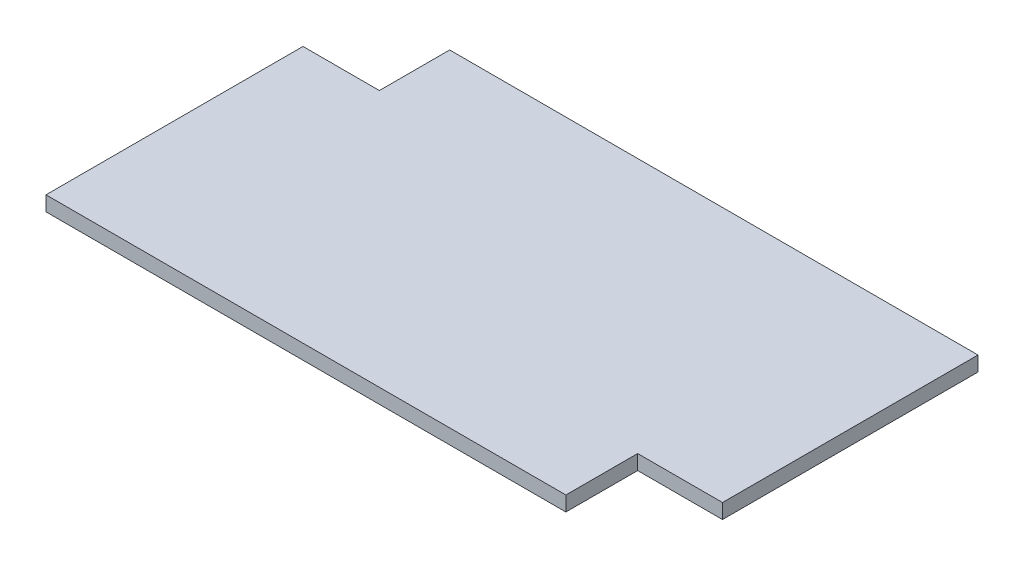
ISO-10303-21;
HEADER;
FILE_DESCRIPTION(('STEP AP214'),'2;1');
FILE_NAME('part.step','',(''),(''),'','','');
FILE_SCHEMA(('AUTOMOTIVE_DESIGN { 1 0 10303 214 1 1 1 1 }'));
ENDSEC;
DATA;
#1=APPLICATION_CONTEXT('core data for automotive mechanical design processes');
#2=APPLICATION_PROTOCOL_DEFINITION('international standard','automotive_design',2000,#1);
#3=PRODUCT_CONTEXT('',#1,'mechanical');
#4=PRODUCT('Part','Part','',(#3));
#5=PRODUCT_RELATED_PRODUCT_CATEGORY('part','',(#4));
#6=PRODUCT_DEFINITION_FORMATION('','',#4);
#7=PRODUCT_DEFINITION_CONTEXT('part definition',#1,'design');
#8=PRODUCT_DEFINITION('design','',#6,#7);
#9=PRODUCT_DEFINITION_SHAPE('','',#8);
#10=(LENGTH_UNIT() NAMED_UNIT(*) SI_UNIT(.MILLI.,.METRE.));
#11=(NAMED_UNIT(*) PLANE_ANGLE_UNIT() SI_UNIT($,.RADIAN.));
#12=(NAMED_UNIT(*) SI_UNIT($,.STERADIAN.) SOLID_ANGLE_UNIT());
#13=UNCERTAINTY_MEASURE_WITH_UNIT(LENGTH_MEASURE(1.E-05),#10,'distance_accuracy_value','');
#14=(GEOMETRIC_REPRESENTATION_CONTEXT(3) GLOBAL_UNCERTAINTY_ASSIGNED_CONTEXT((#13)) GLOBAL_UNIT_ASSIGNED_CONTEXT((#10,
#11,#12)) REPRESENTATION_CONTEXT('',''));
#15=CARTESIAN_POINT('',(0.,0.,0.));
#16=DIRECTION('',(0.,0.,1.));
#17=DIRECTION('',(1.,0.,0.));
#18=AXIS2_PLACEMENT_3D('',#15,#16,#17);
#19=CARTESIAN_POINT('',(62.5573089688317,3.,-17.5518394228049));
#20=DIRECTION('',(-1.,0.,0.));
#21=DIRECTION('',(0.,0.,1.));
#22=AXIS2_PLACEMENT_3D('',#19,#20,#21);
#23=PLANE('',#22);
#24=DIRECTION('',(0.,0.,-1.));
#25=VECTOR('',#24,1.);
#26=CARTESIAN_POINT('',(62.5573089688317,0.,-17.5518394228049));
#27=LINE('',#26,#25);
#28=CARTESIAN_POINT('',(62.5573089688317,0.,34.3263248161733));
#29=VERTEX_POINT('',#28);
#30=CARTESIAN_POINT('',(62.5573089688317,0.,-17.5518394228049));
#31=VERTEX_POINT('',#30);
#32=EDGE_CURVE('E133',#29,#31,#27,.T.);
#33=ORIENTED_EDGE('',*,*,#32,.T.);
#34=DIRECTION('',(0.,-1.,0.));
#35=VECTOR('',#34,1.);
#36=CARTESIAN_POINT('',(62.5573089688317,3.,-17.5518394228049));
#37=LINE('',#36,#35);
#38=CARTESIAN_POINT('',(62.5573089688317,3.,-17.5518394228049));
#39=VERTEX_POINT('',#38);
#40=EDGE_CURVE('E11',#39,#31,#37,.T.);
#41=ORIENTED_EDGE('',*,*,#40,.F.);
#42=DIRECTION('',(0.,0.,-1.));
#43=VECTOR('',#42,1.);
#44=CARTESIAN_POINT('',(62.5573089688317,3.,-17.5518394228049));
#45=LINE('',#44,#43);
#46=CARTESIAN_POINT('',(62.5573089688317,3.,34.3263248161733));
#47=VERTEX_POINT('',#46);
#48=EDGE_CURVE('E147',#47,#39,#45,.T.);
#49=ORIENTED_EDGE('',*,*,#48,.F.);
#50=DIRECTION('',(0.,-1.,0.));
#51=VECTOR('',#50,1.);
#52=CARTESIAN_POINT('',(62.5573089688317,3.,34.3263248161733));
#53=LINE('',#52,#51);
#54=EDGE_CURVE('E129',#47,#29,#53,.T.);
#55=ORIENTED_EDGE('',*,*,#54,.T.);
#56=EDGE_LOOP('',(#33,#41,#49,#55));
#57=FACE_BOUND('',#56,.T.);
#58=ADVANCED_FACE('F37',(#57),#23,.F.);
#59=CARTESIAN_POINT('',(62.5573089688317,3.,-17.5518394228049));
#60=DIRECTION('',(0.,0.,1.));
#61=DIRECTION('',(1.,0.,0.));
#62=AXIS2_PLACEMENT_3D('',#59,#60,#61);
#63=PLANE('',#62);
#64=DIRECTION('',(-1.,0.,0.));
#65=VECTOR('',#64,1.);
#66=CARTESIAN_POINT('',(62.5573089688317,0.,-17.5518394228049));
#67=LINE('',#66,#65);
#68=CARTESIAN_POINT('',(-44.7186115124712,0.,-17.5518394228049));
#69=VERTEX_POINT('',#68);
#70=EDGE_CURVE('E136',#31,#69,#67,.T.);
#71=ORIENTED_EDGE('',*,*,#70,.T.);
#72=DIRECTION('',(0.,-1.,0.));
#73=VECTOR('',#72,1.);
#74=CARTESIAN_POINT('',(-44.7186115124712,3.,-17.5518394228049));
#75=LINE('',#74,#73);
#76=CARTESIAN_POINT('',(-44.7186115124712,3.,-17.5518394228049));
#77=VERTEX_POINT('',#76);
#78=EDGE_CURVE('E45',#77,#69,#75,.T.);
#79=ORIENTED_EDGE('',*,*,#78,.F.);
#80=DIRECTION('',(-1.,0.,0.));
#81=VECTOR('',#80,1.);
#82=CARTESIAN_POINT('',(62.5573089688317,3.,-17.5518394228049));
#83=LINE('',#82,#81);
#84=EDGE_CURVE('E96',#39,#77,#83,.T.);
#85=ORIENTED_EDGE('',*,*,#84,.F.);
#86=ORIENTED_EDGE('',*,*,#40,.T.);
#87=EDGE_LOOP('',(#71,#79,#85,#86));
#88=FACE_BOUND('',#87,.T.);
#89=ADVANCED_FACE('F182',(#88),#63,.F.);
#90=CARTESIAN_POINT('',(-44.7186115124712,3.,-3.28093689020645));
#91=DIRECTION('',(1.,0.,0.));
#92=DIRECTION('',(0.,0.,-1.));
#93=AXIS2_PLACEMENT_3D('',#90,#91,#92);
#94=PLANE('',#93);
#95=DIRECTION('',(0.,0.,1.));
#96=VECTOR('',#95,1.);
#97=CARTESIAN_POINT('',(-44.7186115124712,0.,-3.28093689020645));
#98=LINE('',#97,#96);
#99=CARTESIAN_POINT('',(-44.7186115124712,0.,-3.28093689020645));
#100=VERTEX_POINT('',#99);
#101=EDGE_CURVE('E138',#69,#100,#98,.T.);
#102=ORIENTED_EDGE('',*,*,#101,.T.);
#103=DIRECTION('',(0.,-1.,0.));
#104=VECTOR('',#103,1.);
#105=CARTESIAN_POINT('',(-44.7186115124712,3.,-3.28093689020645));
#106=LINE('',#105,#104);
#107=CARTESIAN_POINT('',(-44.7186115124712,3.,-3.28093689020645));
#108=VERTEX_POINT('',#107);
#109=EDGE_CURVE('E154',#108,#100,#106,.T.);
#110=ORIENTED_EDGE('',*,*,#109,.F.);
#111=DIRECTION('',(0.,0.,1.));
#112=VECTOR('',#111,1.);
#113=CARTESIAN_POINT('',(-44.7186115124712,3.,-3.28093689020645));
#114=LINE('',#113,#112);
#115=EDGE_CURVE('E162',#77,#108,#114,.T.);
#116=ORIENTED_EDGE('',*,*,#115,.F.);
#117=ORIENTED_EDGE('',*,*,#78,.T.);
#118=EDGE_LOOP('',(#102,#110,#116,#117));
#119=FACE_BOUND('',#118,.T.);
#120=ADVANCED_FACE('F160',(#119),#94,.F.);
#121=CARTESIAN_POINT('',(-60.2273212246514,3.,-3.28093689020645));
#122=DIRECTION('',(0.,0.,1.));
#123=DIRECTION('',(1.,0.,0.));
#124=AXIS2_PLACEMENT_3D('',#121,#122,#123);
#125=PLANE('',#124);
#126=DIRECTION('',(-1.,0.,0.));
#127=VECTOR('',#126,1.);
#128=CARTESIAN_POINT('',(-60.2273212246514,0.,-3.28093689020645));
#129=LINE('',#128,#127);
#130=CARTESIAN_POINT('',(-60.2273212246514,0.,-3.28093689020645));
#131=VERTEX_POINT('',#130);
#132=EDGE_CURVE('E140',#100,#131,#129,.T.);
#133=ORIENTED_EDGE('',*,*,#132,.T.);
#134=DIRECTION('',(0.,-1.,0.));
#135=VECTOR('',#134,1.);
#136=CARTESIAN_POINT('',(-60.2273212246514,3.,-3.28093689020645));
#137=LINE('',#136,#135);
#138=CARTESIAN_POINT('',(-60.2273212246514,3.,-3.28093689020645));
#139=VERTEX_POINT('',#138);
#140=EDGE_CURVE('E151',#139,#131,#137,.T.);
#141=ORIENTED_EDGE('',*,*,#140,.F.);
#142=DIRECTION('',(-1.,0.,0.));
#143=VECTOR('',#142,1.);
#144=CARTESIAN_POINT('',(-60.2273212246514,3.,-3.28093689020645));
#145=LINE('',#144,#143);
#146=EDGE_CURVE('E174',#108,#139,#145,.T.);
#147=ORIENTED_EDGE('',*,*,#146,.F.);
#148=ORIENTED_EDGE('',*,*,#109,.T.);
#149=EDGE_LOOP('',(#133,#141,#147,#148));
#150=FACE_BOUND('',#149,.T.);
#151=ADVANCED_FACE('F170',(#150),#125,.F.);
#152=CARTESIAN_POINT('',(-60.2273212246514,3.,-3.28093689020645));
#153=DIRECTION('',(1.,0.,0.));
#154=DIRECTION('',(0.,0.,-1.));
#155=AXIS2_PLACEMENT_3D('',#152,#153,#154);
#156=PLANE('',#155);
#157=DIRECTION('',(0.,0.,1.));
#158=VECTOR('',#157,1.);
#159=CARTESIAN_POINT('',(-60.2273212246514,0.,-3.28093689020645));
#160=LINE('',#159,#158);
#161=CARTESIAN_POINT('',(-60.2273212246514,0.,48.9001947582394));
#162=VERTEX_POINT('',#161);
#163=EDGE_CURVE('E142',#131,#162,#160,.T.);
#164=ORIENTED_EDGE('',*,*,#163,.T.);
#165=DIRECTION('',(0.,-1.,0.));
#166=VECTOR('',#165,1.);
#167=CARTESIAN_POINT('',(-60.2273212246514,3.,48.9001947582394));
#168=LINE('',#167,#166);
#169=CARTESIAN_POINT('',(-60.2273212246514,3.,48.9001947582394));
#170=VERTEX_POINT('',#169);
#171=EDGE_CURVE('E124',#170,#162,#168,.T.);
#172=ORIENTED_EDGE('',*,*,#171,.F.);
#173=DIRECTION('',(0.,0.,1.));
#174=VECTOR('',#173,1.);
#175=CARTESIAN_POINT('',(-60.2273212246514,3.,-3.28093689020645));
#176=LINE('',#175,#174);
#177=EDGE_CURVE('E115',#139,#170,#176,.T.);
#178=ORIENTED_EDGE('',*,*,#177,.F.);
#179=ORIENTED_EDGE('',*,*,#140,.T.);
#180=EDGE_LOOP('',(#164,#172,#178,#179));
#181=FACE_BOUND('',#180,.T.);
#182=ADVANCED_FACE('F173',(#181),#156,.F.);
#183=CARTESIAN_POINT('',(45.3312162182008,3.,48.9001947582393));
#184=DIRECTION('',(0.,0.,-1.));
#185=DIRECTION('',(-1.,0.,0.));
#186=AXIS2_PLACEMENT_3D('',#183,#184,#185);
#187=PLANE('',#186);
#188=DIRECTION('',(1.,0.,0.));
#189=VECTOR('',#188,1.);
#190=CARTESIAN_POINT('',(45.3312162182008,0.,48.9001947582393));
#191=LINE('',#190,#189);
#192=CARTESIAN_POINT('',(45.3312162182008,0.,48.9001947582393));
#193=VERTEX_POINT('',#192);
#194=EDGE_CURVE('E123',#162,#193,#191,.T.);
#195=ORIENTED_EDGE('',*,*,#194,.T.);
#196=DIRECTION('',(0.,-1.,0.));
#197=VECTOR('',#196,1.);
#198=CARTESIAN_POINT('',(45.3312162182008,3.,48.9001947582393));
#199=LINE('',#198,#197);
#200=CARTESIAN_POINT('',(45.3312162182008,3.,48.9001947582393));
#201=VERTEX_POINT('',#200);
#202=EDGE_CURVE('E120',#201,#193,#199,.T.);
#203=ORIENTED_EDGE('',*,*,#202,.F.);
#204=DIRECTION('',(1.,0.,0.));
#205=VECTOR('',#204,1.);
#206=CARTESIAN_POINT('',(45.3312162182008,3.,48.9001947582393));
#207=LINE('',#206,#205);
#208=EDGE_CURVE('E109',#170,#201,#207,.T.);
#209=ORIENTED_EDGE('',*,*,#208,.F.);
#210=ORIENTED_EDGE('',*,*,#171,.T.);
#211=EDGE_LOOP('',(#195,#203,#209,#210));
#212=FACE_BOUND('',#211,.T.);
#213=ADVANCED_FACE('F121',(#212),#187,.F.);
#214=CARTESIAN_POINT('',(45.3312162182008,3.,48.9001947582393));
#215=DIRECTION('',(-1.,0.,0.));
#216=DIRECTION('',(0.,0.,1.));
#217=AXIS2_PLACEMENT_3D('',#214,#215,#216);
#218=PLANE('',#217);
#219=DIRECTION('',(0.,0.,-1.));
#220=VECTOR('',#219,1.);
#221=CARTESIAN_POINT('',(45.3312162182008,0.,48.9001947582393));
#222=LINE('',#221,#220);
#223=CARTESIAN_POINT('',(45.3312162182008,0.,34.3263248161733));
#224=VERTEX_POINT('',#223);
#225=EDGE_CURVE('E82',#193,#224,#222,.T.);
#226=ORIENTED_EDGE('',*,*,#225,.T.);
#227=DIRECTION('',(0.,-1.,0.));
#228=VECTOR('',#227,1.);
#229=CARTESIAN_POINT('',(45.3312162182008,3.,34.3263248161733));
#230=LINE('',#229,#228);
#231=CARTESIAN_POINT('',(45.3312162182008,3.,34.3263248161733));
#232=VERTEX_POINT('',#231);
#233=EDGE_CURVE('E125',#232,#224,#230,.T.);
#234=ORIENTED_EDGE('',*,*,#233,.F.);
#235=DIRECTION('',(0.,0.,-1.));
#236=VECTOR('',#235,1.);
#237=CARTESIAN_POINT('',(45.3312162182008,3.,48.9001947582393));
#238=LINE('',#237,#236);
#239=EDGE_CURVE('E113',#201,#232,#238,.T.);
#240=ORIENTED_EDGE('',*,*,#239,.F.);
#241=ORIENTED_EDGE('',*,*,#202,.T.);
#242=EDGE_LOOP('',(#226,#234,#240,#241));
#243=FACE_BOUND('',#242,.T.);
#244=ADVANCED_FACE('F127',(#243),#218,.F.);
#245=CARTESIAN_POINT('',(45.3312162182008,3.,34.3263248161733));
#246=DIRECTION('',(0.,0.,-1.));
#247=DIRECTION('',(-1.,0.,0.));
#248=AXIS2_PLACEMENT_3D('',#245,#246,#247);
#249=PLANE('',#248);
#250=DIRECTION('',(1.,0.,0.));
#251=VECTOR('',#250,1.);
#252=CARTESIAN_POINT('',(45.3312162182008,0.,34.3263248161733));
#253=LINE('',#252,#251);
#254=EDGE_CURVE('E88',#224,#29,#253,.T.);
#255=ORIENTED_EDGE('',*,*,#254,.T.);
#256=ORIENTED_EDGE('',*,*,#54,.F.);
#257=DIRECTION('',(1.,0.,0.));
#258=VECTOR('',#257,1.);
#259=CARTESIAN_POINT('',(45.3312162182008,3.,34.3263248161733));
#260=LINE('',#259,#258);
#261=EDGE_CURVE('E53',#232,#47,#260,.T.);
#262=ORIENTED_EDGE('',*,*,#261,.F.);
#263=ORIENTED_EDGE('',*,*,#233,.T.);
#264=EDGE_LOOP('',(#255,#256,#262,#263));
#265=FACE_BOUND('',#264,.T.);
#266=ADVANCED_FACE('F198',(#265),#249,.F.);
#267=CARTESIAN_POINT('',(0.,3.,0.));
#268=DIRECTION('',(0.,1.,0.));
#269=DIRECTION('',(0.,0.,1.));
#270=AXIS2_PLACEMENT_3D('',#267,#268,#269);
#271=PLANE('',#270);
#272=ORIENTED_EDGE('',*,*,#48,.T.);
#273=ORIENTED_EDGE('',*,*,#84,.T.);
#274=ORIENTED_EDGE('',*,*,#115,.T.);
#275=ORIENTED_EDGE('',*,*,#146,.T.);
#276=ORIENTED_EDGE('',*,*,#177,.T.);
#277=ORIENTED_EDGE('',*,*,#208,.T.);
#278=ORIENTED_EDGE('',*,*,#239,.T.);
#279=ORIENTED_EDGE('',*,*,#261,.T.);
#280=EDGE_LOOP('',(#272,#273,#274,#275,#276,#277,#278,#279));
#281=FACE_BOUND('',#280,.T.);
#282=ADVANCED_FACE('F111',(#281),#271,.T.);
#283=CARTESIAN_POINT('',(0.,0.,0.));
#284=DIRECTION('',(0.,1.,0.));
#285=DIRECTION('',(0.,0.,1.));
#286=AXIS2_PLACEMENT_3D('',#283,#284,#285);
#287=PLANE('',#286);
#288=ORIENTED_EDGE('',*,*,#32,.F.);
#289=ORIENTED_EDGE('',*,*,#254,.F.);
#290=ORIENTED_EDGE('',*,*,#225,.F.);
#291=ORIENTED_EDGE('',*,*,#194,.F.);
#292=ORIENTED_EDGE('',*,*,#163,.F.);
#293=ORIENTED_EDGE('',*,*,#132,.F.);
#294=ORIENTED_EDGE('',*,*,#101,.F.);
#295=ORIENTED_EDGE('',*,*,#70,.F.);
#296=EDGE_LOOP('',(#288,#289,#290,#291,#292,#293,#294,#295));
#297=FACE_BOUND('',#296,.T.);
#298=ADVANCED_FACE('F166',(#297),#287,.F.);
#299=CLOSED_SHELL('',(#58,#89,#120,#151,#182,#213,#244,#266,#282,#298));
#300=MANIFOLD_SOLID_BREP('B2',#299);
#301=ADVANCED_BREP_SHAPE_REPRESENTATION('',(#18,#300),#14);
#302=SHAPE_DEFINITION_REPRESENTATION(#9,#301);
ENDSEC;
END-ISO-10303-21;
